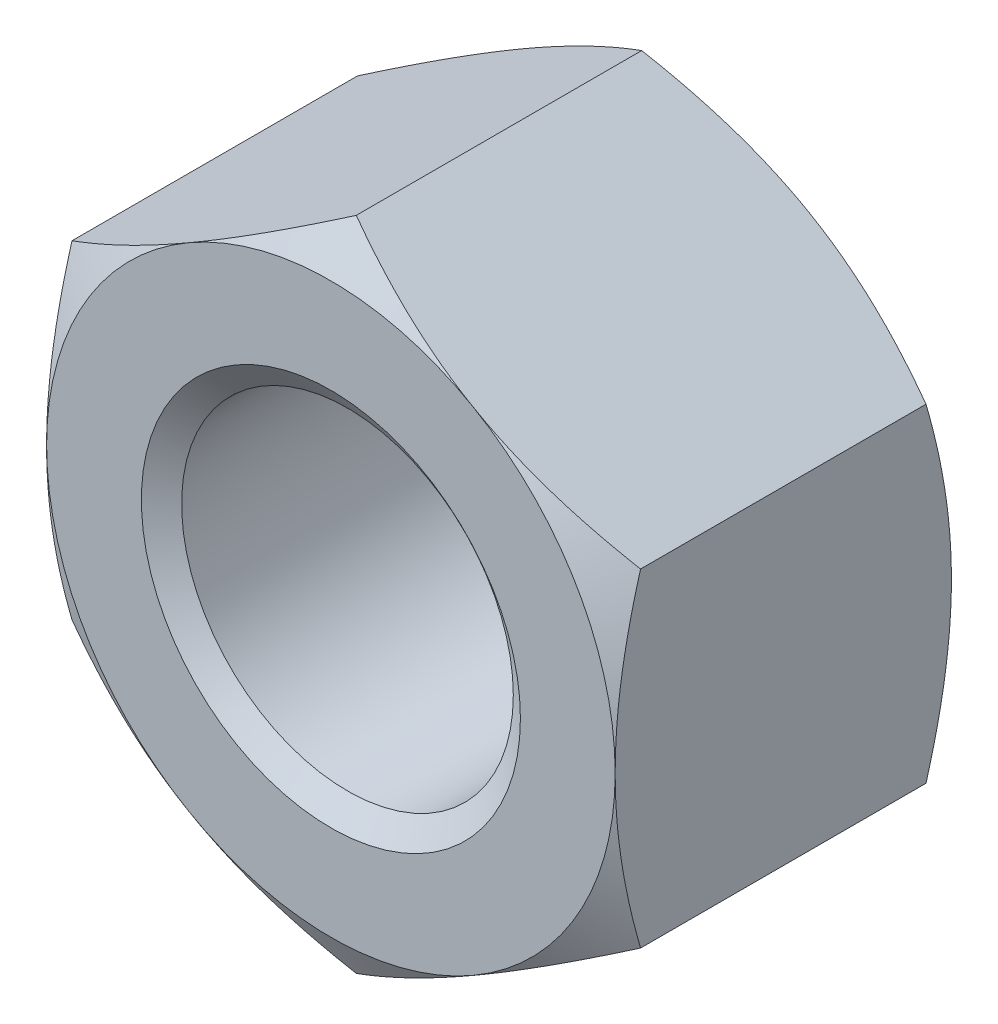
ISO-10303-21;
HEADER;
FILE_DESCRIPTION(('STEP AP214'),'2;1');
FILE_NAME('part.step','',(''),(''),'','','');
FILE_SCHEMA(('AUTOMOTIVE_DESIGN { 1 0 10303 214 1 1 1 1 }'));
ENDSEC;
DATA;
#1=APPLICATION_CONTEXT('core data for automotive mechanical design processes');
#2=APPLICATION_PROTOCOL_DEFINITION('international standard','automotive_design',2000,#1);
#3=PRODUCT_CONTEXT('',#1,'mechanical');
#4=PRODUCT('Part','Part','',(#3));
#5=PRODUCT_RELATED_PRODUCT_CATEGORY('part','',(#4));
#6=PRODUCT_DEFINITION_FORMATION('','',#4);
#7=PRODUCT_DEFINITION_CONTEXT('part definition',#1,'design');
#8=PRODUCT_DEFINITION('design','',#6,#7);
#9=PRODUCT_DEFINITION_SHAPE('','',#8);
#10=(LENGTH_UNIT() NAMED_UNIT(*) SI_UNIT(.MILLI.,.METRE.));
#11=(NAMED_UNIT(*) PLANE_ANGLE_UNIT() SI_UNIT($,.RADIAN.));
#12=(NAMED_UNIT(*) SI_UNIT($,.STERADIAN.) SOLID_ANGLE_UNIT());
#13=UNCERTAINTY_MEASURE_WITH_UNIT(LENGTH_MEASURE(1.E-05),#10,'distance_accuracy_value','');
#14=(GEOMETRIC_REPRESENTATION_CONTEXT(3) GLOBAL_UNCERTAINTY_ASSIGNED_CONTEXT((#13)) GLOBAL_UNIT_ASSIGNED_CONTEXT((#10,
#11,#12)) REPRESENTATION_CONTEXT('',''));
#15=CARTESIAN_POINT('',(0.,0.,0.));
#16=DIRECTION('',(0.,0.,1.));
#17=DIRECTION('',(1.,0.,0.));
#18=AXIS2_PLACEMENT_3D('',#15,#16,#17);
#19=CARTESIAN_POINT('',(-4.03703446649341,-0.35626989989183,-0.699912876064719));
#20=DIRECTION('',(0.,0.,1.));
#21=DIRECTION('',(1.,0.,0.));
#22=AXIS2_PLACEMENT_3D('',#19,#20,#21);
#23=CYLINDRICAL_SURFACE('',#22,1.51534090909091);
#24=CARTESIAN_POINT('',(-4.03703446649341,-0.35626989989183,2.22075356026602));
#25=DIRECTION('',(0.,0.,1.));
#26=DIRECTION('',(1.,0.,0.));
#27=AXIS2_PLACEMENT_3D('',#24,#25,#26);
#28=CIRCLE('',#27,1.51534090909091);
#29=CARTESIAN_POINT('',(-2.5216935574025,-0.35626989989183,2.22075356026602));
#30=VERTEX_POINT('',#29);
#31=EDGE_CURVE('E149',#30,#30,#28,.F.);
#32=ORIENTED_EDGE('',*,*,#31,.F.);
#33=EDGE_LOOP('',(#32));
#34=FACE_BOUND('',#33,.T.);
#35=CARTESIAN_POINT('',(-4.03703446649341,-0.35626989989183,-0.544870221486366));
#36=DIRECTION('',(0.,0.,-1.));
#37=DIRECTION('',(-1.,0.,0.));
#38=AXIS2_PLACEMENT_3D('',#35,#36,#37);
#39=CIRCLE('',#38,1.51534090909091);
#40=CARTESIAN_POINT('',(-5.55237537558432,-0.35626989989183,-0.544870221486366));
#41=VERTEX_POINT('',#40);
#42=EDGE_CURVE('E40',#41,#41,#39,.F.);
#43=ORIENTED_EDGE('',*,*,#42,.F.);
#44=EDGE_LOOP('',(#43));
#45=FACE_BOUND('',#44,.T.);
#46=ADVANCED_FACE('F35',(#34,#45),#23,.F.);
#47=CARTESIAN_POINT('',(-4.03703446649341,2.64332718048882,-0.699912876064719));
#48=DIRECTION('',(-0.500000000000001,0.866025403784438,0.));
#49=DIRECTION('',(-0.866025403784438,-0.500000000000001,0.));
#50=AXIS2_PLACEMENT_3D('',#47,#48,#49);
#51=PLANE('',#50);
#52=DIRECTION('',(0.,0.,1.));
#53=VECTOR('',#52,1.);
#54=CARTESIAN_POINT('',(-6.63476173922068,1.14352864029849,-0.699912876064719));
#55=LINE('',#54,#53);
#56=CARTESIAN_POINT('',(-6.63476173922068,1.1435286402985,-0.467893234436859));
#57=VERTEX_POINT('',#56);
#58=CARTESIAN_POINT('',(-6.63476173922068,1.14352864029849,2.14031293685288));
#59=VERTEX_POINT('',#58);
#60=EDGE_CURVE('E268',#57,#59,#55,.T.);
#61=ORIENTED_EDGE('',*,*,#60,.T.);
#62=CARTESIAN_POINT('',(-6.63478901194796,1.14351289438206,2.14030384587221));
#63=CARTESIAN_POINT('',(-6.52063417047642,1.20942022283495,2.17836708337785));
#64=CARTESIAN_POINT('',(-6.40549394705117,1.27589646182407,2.21298371984822));
#65=CARTESIAN_POINT('',(-6.17321988673153,1.40999995307538,2.27340628085991));
#66=CARTESIAN_POINT('',(-6.05608192384215,1.47762958748189,2.29919083206982));
#67=CARTESIAN_POINT('',(-5.82325764393554,1.61205074815985,2.33932670307745));
#68=CARTESIAN_POINT('',(-5.70760714175726,1.6788215967244,2.35394517441566));
#69=CARTESIAN_POINT('',(-5.47576219338577,1.81267734007693,2.37139393393209));
#70=CARTESIAN_POINT('',(-5.35956858941739,1.87976174860619,2.37423867400263));
#71=CARTESIAN_POINT('',(-5.14246971061747,2.00510384472209,2.36830839386263));
#72=CARTESIAN_POINT('',(-5.04153187324074,2.06338033230297,2.3609894548558));
#73=CARTESIAN_POINT('',(-4.84031378169044,2.17955365162535,2.33779651566822));
#74=CARTESIAN_POINT('',(-4.74003422305834,2.23745008179581,2.3219145990924));
#75=CARTESIAN_POINT('',(-4.53840153777838,2.35386276691963,2.28221253175853));
#76=CARTESIAN_POINT('',(-4.43707392013165,2.41236429424431,2.25822414990124));
#77=CARTESIAN_POINT('',(-4.23592962770355,2.52849500562363,2.20378053024325));
#78=CARTESIAN_POINT('',(-4.13611037762921,2.58612567652436,2.17333807793069));
#79=CARTESIAN_POINT('',(-4.03700719376614,2.64334292640525,2.1403038458722));
#80=B_SPLINE_CURVE_WITH_KNOTS('',3,(#62,#63,#64,#65,#66,#67,#68,#69,#70,#71,#72,#73,#74,#75,#76,
#77,#78,#79),.UNSPECIFIED.,.F.,.F.,(4,2,2,2,2,2,2,2,4),(0.,0.411762725757496,0.824514976974964,
1.22705267824216,1.62909613007785,1.97911081594798,2.32944964345564,2.68755773722039,
3.0449629404558),.UNSPECIFIED.);
#81=CARTESIAN_POINT('',(-5.33589810285705,1.89342791039365,2.37233257848074));
#82=VERTEX_POINT('',#81);
#83=EDGE_CURVE('E62',#59,#82,#80,.T.);
#84=ORIENTED_EDGE('',*,*,#83,.T.);
#85=CARTESIAN_POINT('',(-4.03703446649341,2.64332718048882,2.14031293685288));
#86=VERTEX_POINT('',#85);
#87=EDGE_CURVE('E141',#82,#86,#80,.T.);
#88=ORIENTED_EDGE('',*,*,#87,.T.);
#89=DIRECTION('',(0.,0.,1.));
#90=VECTOR('',#89,1.);
#91=CARTESIAN_POINT('',(-4.03703446649341,2.64332718048882,-0.699912876064719));
#92=LINE('',#91,#90);
#93=CARTESIAN_POINT('',(-4.03703446649341,2.64332718048882,-0.467893234436859));
#94=VERTEX_POINT('',#93);
#95=EDGE_CURVE('E155',#94,#86,#92,.T.);
#96=ORIENTED_EDGE('',*,*,#95,.F.);
#97=CARTESIAN_POINT('',(-6.63478901194796,1.14351289438206,-0.467884143456188));
#98=CARTESIAN_POINT('',(-6.52063417047642,1.20942022283495,-0.505947380961837));
#99=CARTESIAN_POINT('',(-6.40549394705117,1.27589646182407,-0.540564017432208));
#100=CARTESIAN_POINT('',(-6.17321988673153,1.40999995307538,-0.600986578443897));
#101=CARTESIAN_POINT('',(-6.05608192384215,1.47762958748189,-0.626771129653804));
#102=CARTESIAN_POINT('',(-5.82325764393554,1.61205074815985,-0.666907000661433));
#103=CARTESIAN_POINT('',(-5.70760714175726,1.6788215967244,-0.681525471999648));
#104=CARTESIAN_POINT('',(-5.47576219338577,1.81267734007693,-0.698974231516077));
#105=CARTESIAN_POINT('',(-5.35956858941739,1.87976174860619,-0.701818971586614));
#106=CARTESIAN_POINT('',(-5.14246971061747,2.00510384472209,-0.695888691446617));
#107=CARTESIAN_POINT('',(-5.04153187324074,2.06338033230297,-0.688569752439784));
#108=CARTESIAN_POINT('',(-4.84031378169044,2.17955365162535,-0.665376813252201));
#109=CARTESIAN_POINT('',(-4.74003422305835,2.23745008179581,-0.649494896676388));
#110=CARTESIAN_POINT('',(-4.53840153777838,2.35386276691963,-0.609792829342515));
#111=CARTESIAN_POINT('',(-4.43707392013165,2.41236429424431,-0.585804447485223));
#112=CARTESIAN_POINT('',(-4.23592962770354,2.52849500562363,-0.531360827827237));
#113=CARTESIAN_POINT('',(-4.13611037762921,2.58612567652436,-0.500918375514676));
#114=CARTESIAN_POINT('',(-4.03700719376614,2.64334292640525,-0.467884143456187));
#115=B_SPLINE_CURVE_WITH_KNOTS('',3,(#97,#98,#99,#100,#101,#102,#103,#104,#105,#106,#107,#108,
#109,#110,#111,#112,#113,#114),.UNSPECIFIED.,.F.,.F.,(4,2,2,2,2,2,2,2,4),(0.,0.411762725757496,
0.824514976974963,1.22705267824216,1.62909613007784,1.97911081594798,2.32944964345564,
2.68755773722039,3.0449629404558),.UNSPECIFIED.);
#116=CARTESIAN_POINT('',(-5.33589810285705,1.89342791039365,-0.699912876064719));
#117=VERTEX_POINT('',#116);
#118=EDGE_CURVE('E247',#117,#94,#115,.T.);
#119=ORIENTED_EDGE('',*,*,#118,.F.);
#120=EDGE_CURVE('E233',#57,#117,#115,.T.);
#121=ORIENTED_EDGE('',*,*,#120,.F.);
#122=EDGE_LOOP('',(#61,#84,#88,#96,#119,#121));
#123=FACE_BOUND('',#122,.T.);
#124=ADVANCED_FACE('F37',(#123),#51,.T.);
#125=CARTESIAN_POINT('',(-1.43930719376614,1.14352864029849,-0.699912876064719));
#126=DIRECTION('',(0.500000000000001,0.866025403784438,0.));
#127=DIRECTION('',(-0.866025403784438,0.500000000000001,0.));
#128=AXIS2_PLACEMENT_3D('',#125,#126,#127);
#129=PLANE('',#128);
#130=ORIENTED_EDGE('',*,*,#95,.T.);
#131=CARTESIAN_POINT('',(-4.03706173922068,2.64334292640525,2.1403038458722));
#132=CARTESIAN_POINT('',(-3.92290689774914,2.57743559795236,2.17836708337785));
#133=CARTESIAN_POINT('',(-3.80776667432389,2.51095935896324,2.21298371984822));
#134=CARTESIAN_POINT('',(-3.57549261400426,2.37685586771193,2.27340628085991));
#135=CARTESIAN_POINT('',(-3.45835465111487,2.30922623330542,2.29919083206982));
#136=CARTESIAN_POINT('',(-3.22553037120827,2.17480507262746,2.33932670307745));
#137=CARTESIAN_POINT('',(-3.10987986902999,2.10803422406291,2.35394517441566));
#138=CARTESIAN_POINT('',(-2.8780349206585,1.97417848071038,2.37139393393209));
#139=CARTESIAN_POINT('',(-2.76184131669011,1.90709407218112,2.37423867400263));
#140=CARTESIAN_POINT('',(-2.5447424378902,1.78175197606522,2.36830839386263));
#141=CARTESIAN_POINT('',(-2.44380460051347,1.72347548848434,2.3609894548558));
#142=CARTESIAN_POINT('',(-2.24258650896317,1.60730216916196,2.33779651566822));
#143=CARTESIAN_POINT('',(-2.14230695033107,1.5494057389915,2.32191459909241));
#144=CARTESIAN_POINT('',(-1.94067426505111,1.43299305386768,2.28221253175853));
#145=CARTESIAN_POINT('',(-1.83934664740438,1.374491526543,2.25822414990124));
#146=CARTESIAN_POINT('',(-1.63820235497627,1.25836081516368,2.20378053024325));
#147=CARTESIAN_POINT('',(-1.53838310490194,1.20073014426295,2.17333807793069));
#148=CARTESIAN_POINT('',(-1.43927992103886,1.14351289438206,2.14030384587221));
#149=B_SPLINE_CURVE_WITH_KNOTS('',3,(#131,#132,#133,#134,#135,#136,#137,#138,#139,#140,#141,
#142,#143,#144,#145,#146,#147,#148),.UNSPECIFIED.,.F.,.F.,(4,2,2,2,2,2,2,2,4),(0.,
0.411762725757496,0.824514976974964,1.22705267824216,1.62909613007785,1.97911081594798,
2.32944964345564,2.68755773722039,3.0449629404558),.UNSPECIFIED.);
#150=CARTESIAN_POINT('',(-2.73817083012977,1.89342791039365,2.37233257848074));
#151=VERTEX_POINT('',#150);
#152=EDGE_CURVE('E136',#86,#151,#149,.T.);
#153=ORIENTED_EDGE('',*,*,#152,.T.);
#154=CARTESIAN_POINT('',(-1.43930719376614,1.1435286402985,2.14031293685288));
#155=VERTEX_POINT('',#154);
#156=EDGE_CURVE('E127',#151,#155,#149,.T.);
#157=ORIENTED_EDGE('',*,*,#156,.T.);
#158=DIRECTION('',(0.,0.,1.));
#159=VECTOR('',#158,1.);
#160=CARTESIAN_POINT('',(-1.43930719376614,1.14352864029849,-0.699912876064719));
#161=LINE('',#160,#159);
#162=CARTESIAN_POINT('',(-1.43930719376614,1.1435286402985,-0.467893234436859));
#163=VERTEX_POINT('',#162);
#164=EDGE_CURVE('E257',#163,#155,#161,.T.);
#165=ORIENTED_EDGE('',*,*,#164,.F.);
#166=CARTESIAN_POINT('',(-4.03706173922068,2.64334292640525,-0.467884143456187));
#167=CARTESIAN_POINT('',(-3.92290689774914,2.57743559795236,-0.505947380961835));
#168=CARTESIAN_POINT('',(-3.80776667432389,2.51095935896324,-0.540564017432206));
#169=CARTESIAN_POINT('',(-3.57549261400426,2.37685586771193,-0.600986578443895));
#170=CARTESIAN_POINT('',(-3.45835465111487,2.30922623330542,-0.626771129653803));
#171=CARTESIAN_POINT('',(-3.22553037120827,2.17480507262746,-0.666907000661432));
#172=CARTESIAN_POINT('',(-3.10987986902999,2.10803422406291,-0.681525471999648));
#173=CARTESIAN_POINT('',(-2.8780349206585,1.97417848071038,-0.698974231516077));
#174=CARTESIAN_POINT('',(-2.76184131669011,1.90709407218112,-0.701818971586614));
#175=CARTESIAN_POINT('',(-2.5447424378902,1.78175197606522,-0.695888691446617));
#176=CARTESIAN_POINT('',(-2.44380460051347,1.72347548848434,-0.688569752439785));
#177=CARTESIAN_POINT('',(-2.24258650896317,1.60730216916196,-0.665376813252201));
#178=CARTESIAN_POINT('',(-2.14230695033107,1.5494057389915,-0.649494896676389));
#179=CARTESIAN_POINT('',(-1.9406742650511,1.43299305386768,-0.609792829342516));
#180=CARTESIAN_POINT('',(-1.83934664740438,1.374491526543,-0.585804447485224));
#181=CARTESIAN_POINT('',(-1.63820235497627,1.25836081516368,-0.531360827827239));
#182=CARTESIAN_POINT('',(-1.53838310490194,1.20073014426295,-0.500918375514677));
#183=CARTESIAN_POINT('',(-1.43927992103886,1.14351289438206,-0.467884143456188));
#184=B_SPLINE_CURVE_WITH_KNOTS('',3,(#166,#167,#168,#169,#170,#171,#172,#173,#174,#175,#176,
#177,#178,#179,#180,#181,#182,#183),.UNSPECIFIED.,.F.,.F.,(4,2,2,2,2,2,2,2,4),(0.,
0.411762725757496,0.824514976974964,1.22705267824216,1.62909613007785,1.97911081594798,
2.32944964345564,2.68755773722039,3.0449629404558),.UNSPECIFIED.);
#185=CARTESIAN_POINT('',(-2.73817083012977,1.89342791039365,-0.699912876064719));
#186=VERTEX_POINT('',#185);
#187=EDGE_CURVE('E248',#186,#163,#184,.T.);
#188=ORIENTED_EDGE('',*,*,#187,.F.);
#189=EDGE_CURVE('E254',#94,#186,#184,.T.);
#190=ORIENTED_EDGE('',*,*,#189,.F.);
#191=EDGE_LOOP('',(#130,#153,#157,#165,#188,#190));
#192=FACE_BOUND('',#191,.T.);
#193=ADVANCED_FACE('F152',(#192),#129,.T.);
#194=CARTESIAN_POINT('',(-1.43930719376614,1.14352864029849,-0.699912876064719));
#195=DIRECTION('',(-1.,0.,0.));
#196=DIRECTION('',(0.,0.,1.));
#197=AXIS2_PLACEMENT_3D('',#194,#195,#196);
#198=PLANE('',#197);
#199=CARTESIAN_POINT('',(-1.43930719376614,-4.3339566524617,1.12925070536823));
#200=CARTESIAN_POINT('',(-1.43930719376614,-4.2199017353191,1.18436834127248));
#201=CARTESIAN_POINT('',(-1.43930719376614,-4.10557715469242,1.23893806225811));
#202=CARTESIAN_POINT('',(-1.43930719376614,-3.87624285955771,1.346668576896));
#203=CARTESIAN_POINT('',(-1.43930719376614,-3.76123303059325,1.39982912660817));
#204=CARTESIAN_POINT('',(-1.43930719376614,-3.52976115805929,1.50470825389215));
#205=CARTESIAN_POINT('',(-1.43930719376614,-3.41329457040623,1.55641683873242));
#206=CARTESIAN_POINT('',(-1.43930719376614,-3.17940414202886,1.65761299942654));
#207=CARTESIAN_POINT('',(-1.43930719376614,-3.06198035157966,1.70710069105139));
#208=CARTESIAN_POINT('',(-1.43930719376614,-2.82453103517311,1.8038520140485));
#209=CARTESIAN_POINT('',(-1.43930719376614,-2.70449126634877,1.85108088197011));
#210=CARTESIAN_POINT('',(-1.43930719376614,-2.46299584924777,1.94183966257926));
#211=CARTESIAN_POINT('',(-1.43930719376614,-2.3415400451492,1.98536916373159));
#212=CARTESIAN_POINT('',(-1.43930719376614,-2.09726878491488,2.06755958503955));
#213=CARTESIAN_POINT('',(-1.43930719376614,-1.97445684741333,2.10623085577737));
#214=CARTESIAN_POINT('',(-1.43930719376614,-1.7270870399417,2.17744889863394));
#215=CARTESIAN_POINT('',(-1.43930719376614,-1.60252973553563,2.20999760753726));
#216=CARTESIAN_POINT('',(-1.43930719376614,-1.35158412133525,2.26739037471229));
#217=CARTESIAN_POINT('',(-1.43930719376614,-1.2251953333701,2.29223238152146));
#218=CARTESIAN_POINT('',(-1.43930719376614,-0.970893942887478,2.33253914003799));
#219=CARTESIAN_POINT('',(-1.43930719376614,-0.842981339022862,2.34800388345466));
#220=CARTESIAN_POINT('',(-1.43930719376614,-0.587111731792263,2.3681880259638));
#221=CARTESIAN_POINT('',(-1.43930719376614,-0.459160234312559,2.3729754515318));
#222=CARTESIAN_POINT('',(-1.43930719376614,-0.203346835204729,2.37155061946574));
#223=CARTESIAN_POINT('',(-1.43930719376614,-0.0754849189402348,2.36534121712736));
#224=CARTESIAN_POINT('',(-1.43930719376614,0.142857830825622,2.34578462753566));
#225=CARTESIAN_POINT('',(-1.43930719376614,0.233579548295879,2.33498421178859));
#226=CARTESIAN_POINT('',(-1.43930719376614,0.414322185219373,2.30854966482945));
#227=CARTESIAN_POINT('',(-1.43930719376614,0.504342991852217,2.29291477128881));
#228=CARTESIAN_POINT('',(-1.43930719376614,0.773280662339633,2.23957892728977));
#229=CARTESIAN_POINT('',(-1.43930719376614,0.950936925530459,2.19546054598986));
#230=CARTESIAN_POINT('',(-1.43930719376614,1.21677250462859,2.11936826103781));
#231=CARTESIAN_POINT('',(-1.43930719376614,1.30633748681971,2.09196380831558));
#232=CARTESIAN_POINT('',(-1.43930719376614,1.48453263336326,2.03444321757147));
#233=CARTESIAN_POINT('',(-1.43930719376614,1.5731633960327,2.00432894988891));
#234=CARTESIAN_POINT('',(-1.43930719376614,1.74911947800686,1.94201535452446));
#235=CARTESIAN_POINT('',(-1.43930719376614,1.83644933722878,1.9098287170397));
#236=CARTESIAN_POINT('',(-1.43930719376614,2.01043149270914,1.84356626121782));
#237=CARTESIAN_POINT('',(-1.43930719376614,2.09708349874232,1.80948967933807));
#238=CARTESIAN_POINT('',(-1.43930719376614,2.18342219068641,1.77465462707322));
#239=B_SPLINE_CURVE_WITH_KNOTS('',3,(#199,#200,#201,#202,#203,#204,#205,#206,#207,#208,#209,
#210,#211,#212,#213,#214,#215,#216,#217,#218,#219,#220,#221,#222,#223,#224,#225,#226,#227,#228,
#229,#230,#231,#232,#233,#234,#235,#236,#237,#238),.UNSPECIFIED.,.F.,.F.,(4,2,2,2,2,2,2,2,2,2,2,
2,2,2,2,2,2,2,2,4),(0.,0.380029181172941,0.760123724758491,1.14239339591115,1.5246431168611,
1.91158567806886,2.29857122841938,2.68471778607585,3.07074198562752,3.45686885374169,
3.84299606324005,4.22665609619972,4.61021652750702,4.8841698009293,5.15816629494622,
5.7065670717288,5.98753589323319,6.26831225354494,6.54750821586453,6.82681780759916),.UNSPECIFIED.);
#240=CARTESIAN_POINT('',(-1.43930719376614,-1.85606844008216,2.14031293685288));
#241=VERTEX_POINT('',#240);
#242=CARTESIAN_POINT('',(-1.43930719376614,-0.35626989989183,2.37233257848074));
#243=VERTEX_POINT('',#242);
#244=EDGE_CURVE('E211',#241,#243,#239,.T.);
#245=ORIENTED_EDGE('',*,*,#244,.F.);
#246=DIRECTION('',(0.,0.,1.));
#247=VECTOR('',#246,1.);
#248=CARTESIAN_POINT('',(-1.43930719376614,-1.85606844008216,-0.699912876064719));
#249=LINE('',#248,#247);
#250=CARTESIAN_POINT('',(-1.43930719376614,-1.85606844008216,-0.467893234436859));
#251=VERTEX_POINT('',#250);
#252=EDGE_CURVE('E259',#251,#241,#249,.T.);
#253=ORIENTED_EDGE('',*,*,#252,.F.);
#254=CARTESIAN_POINT('',(-1.43930719376614,-4.3339566524617,0.543168997047789));
#255=CARTESIAN_POINT('',(-1.43930719376614,-4.2199017353191,0.488051361143536));
#256=CARTESIAN_POINT('',(-1.43930719376614,-4.10557715469242,0.433481640157906));
#257=CARTESIAN_POINT('',(-1.43930719376614,-3.87624285955771,0.325751125520012));
#258=CARTESIAN_POINT('',(-1.43930719376614,-3.76123303059325,0.272590575807846));
#259=CARTESIAN_POINT('',(-1.43930719376614,-3.52976115805929,0.167711448523863));
#260=CARTESIAN_POINT('',(-1.43930719376614,-3.41329457040623,0.116002863683592));
#261=CARTESIAN_POINT('',(-1.43930719376614,-3.17940414202886,0.0148067029894731));
#262=CARTESIAN_POINT('',(-1.43930719376614,-3.06198035157966,-0.034680988635374));
#263=CARTESIAN_POINT('',(-1.43930719376614,-2.82453103517311,-0.131432311632481));
#264=CARTESIAN_POINT('',(-1.43930719376614,-2.70449126634877,-0.178661179554097));
#265=CARTESIAN_POINT('',(-1.43930719376614,-2.46299584924777,-0.269419960163239));
#266=CARTESIAN_POINT('',(-1.43930719376614,-2.3415400451492,-0.312949461315569));
#267=CARTESIAN_POINT('',(-1.43930719376614,-2.09726878491488,-0.395139882623531));
#268=CARTESIAN_POINT('',(-1.43930719376614,-1.97445684741333,-0.433811153361356));
#269=CARTESIAN_POINT('',(-1.43930719376614,-1.72708703994169,-0.50502919621792));
#270=CARTESIAN_POINT('',(-1.43930719376614,-1.60252973553563,-0.537577905121239));
#271=CARTESIAN_POINT('',(-1.43930719376614,-1.35158412133525,-0.594970672296271));
#272=CARTESIAN_POINT('',(-1.43930719376614,-1.2251953333701,-0.619812679105443));
#273=CARTESIAN_POINT('',(-1.43930719376614,-0.970893942887477,-0.660119437621969));
#274=CARTESIAN_POINT('',(-1.43930719376614,-0.842981339022862,-0.675584181038643));
#275=CARTESIAN_POINT('',(-1.43930719376614,-0.587111731792263,-0.695768323547783));
#276=CARTESIAN_POINT('',(-1.43930719376614,-0.45916023431256,-0.700555749115782));
#277=CARTESIAN_POINT('',(-1.43930719376614,-0.203346835204729,-0.699130917049725));
#278=CARTESIAN_POINT('',(-1.43930719376614,-0.075484918940235,-0.692921514711342));
#279=CARTESIAN_POINT('',(-1.43930719376614,0.142857830825622,-0.673364925119646));
#280=CARTESIAN_POINT('',(-1.43930719376614,0.233579548295879,-0.66256450937257));
#281=CARTESIAN_POINT('',(-1.43930719376614,0.414322185219373,-0.636129962413435));
#282=CARTESIAN_POINT('',(-1.43930719376614,0.504342991852217,-0.620495068872791));
#283=CARTESIAN_POINT('',(-1.43930719376614,0.773280662339632,-0.567159224873754));
#284=CARTESIAN_POINT('',(-1.43930719376614,0.950936925530458,-0.523040843573848));
#285=CARTESIAN_POINT('',(-1.43930719376614,1.21677250462859,-0.446948558621798));
#286=CARTESIAN_POINT('',(-1.43930719376614,1.30633748681971,-0.419544105899562));
#287=CARTESIAN_POINT('',(-1.43930719376614,1.48453263336326,-0.362023515155454));
#288=CARTESIAN_POINT('',(-1.43930719376614,1.5731633960327,-0.331909247472893));
#289=CARTESIAN_POINT('',(-1.43930719376614,1.74911947800686,-0.269595652108448));
#290=CARTESIAN_POINT('',(-1.43930719376614,1.83644933722878,-0.237409014623685));
#291=CARTESIAN_POINT('',(-1.43930719376614,2.01043149270914,-0.1711465588018));
#292=CARTESIAN_POINT('',(-1.43930719376614,2.09708349874232,-0.137069976922051));
#293=CARTESIAN_POINT('',(-1.43930719376614,2.18342219068641,-0.102234924657201));
#294=B_SPLINE_CURVE_WITH_KNOTS('',3,(#254,#255,#256,#257,#258,#259,#260,#261,#262,#263,#264,
#265,#266,#267,#268,#269,#270,#271,#272,#273,#274,#275,#276,#277,#278,#279,#280,#281,#282,#283,
#284,#285,#286,#287,#288,#289,#290,#291,#292,#293),.UNSPECIFIED.,.F.,.F.,(4,2,2,2,2,2,2,2,2,2,2,
2,2,2,2,2,2,2,2,4),(0.,0.380029181172941,0.760123724758491,1.14239339591115,1.5246431168611,
1.91158567806885,2.29857122841938,2.68471778607585,3.07074198562752,3.45686885374169,
3.84299606324004,4.22665609619972,4.61021652750702,4.8841698009293,5.15816629494622,
5.7065670717288,5.98753589323319,6.26831225354494,6.54750821586452,6.82681780759916),.UNSPECIFIED.);
#295=CARTESIAN_POINT('',(-1.43930719376614,-0.35626989989183,-0.699912876064719));
#296=VERTEX_POINT('',#295);
#297=EDGE_CURVE('E225',#251,#296,#294,.T.);
#298=ORIENTED_EDGE('',*,*,#297,.T.);
#299=EDGE_CURVE('E235',#296,#163,#294,.T.);
#300=ORIENTED_EDGE('',*,*,#299,.T.);
#301=ORIENTED_EDGE('',*,*,#164,.T.);
#302=EDGE_CURVE('E131',#243,#155,#239,.T.);
#303=ORIENTED_EDGE('',*,*,#302,.F.);
#304=EDGE_LOOP('',(#245,#253,#298,#300,#301,#303));
#305=FACE_BOUND('',#304,.T.);
#306=ADVANCED_FACE('F217',(#305),#198,.F.);
#307=CARTESIAN_POINT('',(-4.03703446649341,-3.35586698027248,-0.699912876064719));
#308=DIRECTION('',(0.500000000000001,-0.866025403784438,0.));
#309=DIRECTION('',(0.866025403784438,0.500000000000001,0.));
#310=AXIS2_PLACEMENT_3D('',#307,#308,#309);
#311=PLANE('',#310);
#312=ORIENTED_EDGE('',*,*,#252,.T.);
#313=CARTESIAN_POINT('',(-1.43927992103886,-1.85605269416572,2.1403038458722));
#314=CARTESIAN_POINT('',(-1.5534347625104,-1.92196002261862,2.17836708337785));
#315=CARTESIAN_POINT('',(-1.66857498593565,-1.98843626160774,2.21298371984822));
#316=CARTESIAN_POINT('',(-1.90084904625529,-2.12253975285905,2.27340628085991));
#317=CARTESIAN_POINT('',(-2.01798700914467,-2.19016938726556,2.29919083206982));
#318=CARTESIAN_POINT('',(-2.25081128905128,-2.32459054794352,2.33932670307745));
#319=CARTESIAN_POINT('',(-2.36646179122956,-2.39136139650806,2.35394517441566));
#320=CARTESIAN_POINT('',(-2.59830673960105,-2.5252171398606,2.37139393393209));
#321=CARTESIAN_POINT('',(-2.71450034356943,-2.59230154838986,2.37423867400263));
#322=CARTESIAN_POINT('',(-2.93159922236935,-2.71764364450575,2.36830839386263));
#323=CARTESIAN_POINT('',(-3.03253705974608,-2.77592013208663,2.3609894548558));
#324=CARTESIAN_POINT('',(-3.23375515129638,-2.89209345140902,2.33779651566821));
#325=CARTESIAN_POINT('',(-3.33403470992847,-2.94998988157948,2.3219145990924));
#326=CARTESIAN_POINT('',(-3.53566739520844,-3.06640256670329,2.28221253175853));
#327=CARTESIAN_POINT('',(-3.63699501285517,-3.12490409402798,2.25822414990124));
#328=CARTESIAN_POINT('',(-3.83813930528327,-3.2410348054073,2.20378053024325));
#329=CARTESIAN_POINT('',(-3.93795855535761,-3.29866547630802,2.17333807793069));
#330=CARTESIAN_POINT('',(-4.03706173922068,-3.35588272618892,2.1403038458722));
#331=B_SPLINE_CURVE_WITH_KNOTS('',3,(#313,#314,#315,#316,#317,#318,#319,#320,#321,#322,#323,
#324,#325,#326,#327,#328,#329,#330),.UNSPECIFIED.,.F.,.F.,(4,2,2,2,2,2,2,2,4),(0.,
0.411762725757497,0.824514976974964,1.22705267824216,1.62909613007785,1.97911081594798,
2.32944964345564,2.68755773722039,3.0449629404558),.UNSPECIFIED.);
#332=CARTESIAN_POINT('',(-2.73817083012977,-2.60596771017731,2.37233257848074));
#333=VERTEX_POINT('',#332);
#334=EDGE_CURVE('E216',#241,#333,#331,.T.);
#335=ORIENTED_EDGE('',*,*,#334,.T.);
#336=CARTESIAN_POINT('',(-4.03703446649342,-3.35586698027248,2.14031293685288));
#337=VERTEX_POINT('',#336);
#338=EDGE_CURVE('E205',#333,#337,#331,.T.);
#339=ORIENTED_EDGE('',*,*,#338,.T.);
#340=DIRECTION('',(0.,0.,1.));
#341=VECTOR('',#340,1.);
#342=CARTESIAN_POINT('',(-4.03703446649341,-3.35586698027248,-0.699912876064719));
#343=LINE('',#342,#341);
#344=CARTESIAN_POINT('',(-4.03703446649342,-3.35586698027248,-0.467893234436859));
#345=VERTEX_POINT('',#344);
#346=EDGE_CURVE('E262',#345,#337,#343,.T.);
#347=ORIENTED_EDGE('',*,*,#346,.F.);
#348=CARTESIAN_POINT('',(-1.43927992103886,-1.85605269416572,-0.467884143456187));
#349=CARTESIAN_POINT('',(-1.5534347625104,-1.92196002261862,-0.505947380961835));
#350=CARTESIAN_POINT('',(-1.66857498593565,-1.98843626160774,-0.540564017432206));
#351=CARTESIAN_POINT('',(-1.90084904625529,-2.12253975285905,-0.600986578443895));
#352=CARTESIAN_POINT('',(-2.01798700914467,-2.19016938726556,-0.626771129653802));
#353=CARTESIAN_POINT('',(-2.25081128905128,-2.32459054794352,-0.66690700066143));
#354=CARTESIAN_POINT('',(-2.36646179122956,-2.39136139650806,-0.681525471999646));
#355=CARTESIAN_POINT('',(-2.59830673960105,-2.5252171398606,-0.698974231516074));
#356=CARTESIAN_POINT('',(-2.71450034356943,-2.59230154838986,-0.701818971586611));
#357=CARTESIAN_POINT('',(-2.93159922236935,-2.71764364450575,-0.695888691446614));
#358=CARTESIAN_POINT('',(-3.03253705974608,-2.77592013208663,-0.688569752439781));
#359=CARTESIAN_POINT('',(-3.23375515129638,-2.89209345140902,-0.665376813252197));
#360=CARTESIAN_POINT('',(-3.33403470992847,-2.94998988157948,-0.649494896676384));
#361=CARTESIAN_POINT('',(-3.53566739520844,-3.06640256670329,-0.609792829342511));
#362=CARTESIAN_POINT('',(-3.63699501285517,-3.12490409402798,-0.585804447485219));
#363=CARTESIAN_POINT('',(-3.83813930528327,-3.2410348054073,-0.531360827827233));
#364=CARTESIAN_POINT('',(-3.93795855535761,-3.29866547630802,-0.500918375514671));
#365=CARTESIAN_POINT('',(-4.03706173922068,-3.35588272618892,-0.467884143456183));
#366=B_SPLINE_CURVE_WITH_KNOTS('',3,(#348,#349,#350,#351,#352,#353,#354,#355,#356,#357,#358,
#359,#360,#361,#362,#363,#364,#365),.UNSPECIFIED.,.F.,.F.,(4,2,2,2,2,2,2,2,4),(0.,
0.411762725757496,0.824514976974964,1.22705267824216,1.62909613007785,1.97911081594798,
2.32944964345564,2.68755773722039,3.0449629404558),.UNSPECIFIED.);
#367=CARTESIAN_POINT('',(-2.73817083012977,-2.60596771017731,-0.699912876064719));
#368=VERTEX_POINT('',#367);
#369=EDGE_CURVE('E236',#368,#345,#366,.T.);
#370=ORIENTED_EDGE('',*,*,#369,.F.);
#371=EDGE_CURVE('E234',#251,#368,#366,.T.);
#372=ORIENTED_EDGE('',*,*,#371,.F.);
#373=EDGE_LOOP('',(#312,#335,#339,#347,#370,#372));
#374=FACE_BOUND('',#373,.T.);
#375=ADVANCED_FACE('F220',(#374),#311,.T.);
#376=CARTESIAN_POINT('',(-6.63476173922068,-1.85606844008216,-0.699912876064719));
#377=DIRECTION('',(-0.500000000000001,-0.866025403784438,0.));
#378=DIRECTION('',(0.866025403784438,-0.500000000000001,0.));
#379=AXIS2_PLACEMENT_3D('',#376,#377,#378);
#380=PLANE('',#379);
#381=ORIENTED_EDGE('',*,*,#346,.T.);
#382=CARTESIAN_POINT('',(-4.03700719376614,-3.35588272618892,2.1403038458722));
#383=CARTESIAN_POINT('',(-4.15116203523768,-3.28997539773603,2.17836708337785));
#384=CARTESIAN_POINT('',(-4.26630225866292,-3.2234991587469,2.21298371984822));
#385=CARTESIAN_POINT('',(-4.49857631898256,-3.08939566749559,2.27340628085991));
#386=CARTESIAN_POINT('',(-4.61571428187194,-3.02176603308908,2.29919083206982));
#387=CARTESIAN_POINT('',(-4.84853856177855,-2.88734487241112,2.33932670307745));
#388=CARTESIAN_POINT('',(-4.96418906395683,-2.82057402384658,2.35394517441566));
#389=CARTESIAN_POINT('',(-5.19603401232832,-2.68671828049404,2.37139393393209));
#390=CARTESIAN_POINT('',(-5.31222761629671,-2.61963387196478,2.37423867400263));
#391=CARTESIAN_POINT('',(-5.52932649509662,-2.49429177584889,2.36830839386263));
#392=CARTESIAN_POINT('',(-5.63026433247336,-2.43601528826801,2.3609894548558));
#393=CARTESIAN_POINT('',(-5.83148242402366,-2.31984196894562,2.33779651566821));
#394=CARTESIAN_POINT('',(-5.93176198265575,-2.26194553877516,2.3219145990924));
#395=CARTESIAN_POINT('',(-6.13339466793572,-2.14553285365135,2.28221253175853));
#396=CARTESIAN_POINT('',(-6.23472228558244,-2.08703132632666,2.25822414990124));
#397=CARTESIAN_POINT('',(-6.43586657801055,-1.97090061494734,2.20378053024325));
#398=CARTESIAN_POINT('',(-6.53568582808488,-1.91326994404662,2.17333807793069));
#399=CARTESIAN_POINT('',(-6.63478901194796,-1.85605269416572,2.1403038458722));
#400=B_SPLINE_CURVE_WITH_KNOTS('',3,(#382,#383,#384,#385,#386,#387,#388,#389,#390,#391,#392,
#393,#394,#395,#396,#397,#398,#399),.UNSPECIFIED.,.F.,.F.,(4,2,2,2,2,2,2,2,4),(0.,
0.411762725757497,0.824514976974966,1.22705267824216,1.62909613007785,1.97911081594799,
2.32944964345565,2.68755773722039,3.0449629404558),.UNSPECIFIED.);
#401=CARTESIAN_POINT('',(-5.33589810285705,-2.60596771017731,2.37233257848074));
#402=VERTEX_POINT('',#401);
#403=EDGE_CURVE('E357',#337,#402,#400,.T.);
#404=ORIENTED_EDGE('',*,*,#403,.T.);
#405=CARTESIAN_POINT('',(-6.63476173922068,-1.85606844008216,2.14031293685288));
#406=VERTEX_POINT('',#405);
#407=EDGE_CURVE('E197',#402,#406,#400,.T.);
#408=ORIENTED_EDGE('',*,*,#407,.T.);
#409=DIRECTION('',(0.,0.,1.));
#410=VECTOR('',#409,1.);
#411=CARTESIAN_POINT('',(-6.63476173922068,-1.85606844008216,-0.699912876064719));
#412=LINE('',#411,#410);
#413=CARTESIAN_POINT('',(-6.63476173922068,-1.85606844008216,-0.467893234436859));
#414=VERTEX_POINT('',#413);
#415=EDGE_CURVE('E265',#414,#406,#412,.T.);
#416=ORIENTED_EDGE('',*,*,#415,.F.);
#417=CARTESIAN_POINT('',(-4.03700719376614,-3.35588272618892,-0.467884143456183));
#418=CARTESIAN_POINT('',(-4.15116203523768,-3.28997539773603,-0.505947380961831));
#419=CARTESIAN_POINT('',(-4.26630225866292,-3.2234991587469,-0.540564017432202));
#420=CARTESIAN_POINT('',(-4.49857631898256,-3.08939566749559,-0.600986578443892));
#421=CARTESIAN_POINT('',(-4.61571428187194,-3.02176603308908,-0.626771129653799));
#422=CARTESIAN_POINT('',(-4.84853856177855,-2.88734487241112,-0.666907000661429));
#423=CARTESIAN_POINT('',(-4.96418906395683,-2.82057402384658,-0.681525471999644));
#424=CARTESIAN_POINT('',(-5.19603401232832,-2.68671828049404,-0.698974231516073));
#425=CARTESIAN_POINT('',(-5.31222761629671,-2.61963387196478,-0.701818971586611));
#426=CARTESIAN_POINT('',(-5.52932649509662,-2.49429177584889,-0.695888691446614));
#427=CARTESIAN_POINT('',(-5.63026433247336,-2.43601528826801,-0.688569752439782));
#428=CARTESIAN_POINT('',(-5.83148242402366,-2.31984196894562,-0.665376813252198));
#429=CARTESIAN_POINT('',(-5.93176198265575,-2.26194553877516,-0.649494896676385));
#430=CARTESIAN_POINT('',(-6.13339466793572,-2.14553285365135,-0.609792829342513));
#431=CARTESIAN_POINT('',(-6.23472228558244,-2.08703132632666,-0.585804447485221));
#432=CARTESIAN_POINT('',(-6.43586657801055,-1.97090061494734,-0.531360827827236));
#433=CARTESIAN_POINT('',(-6.53568582808488,-1.91326994404662,-0.500918375514675));
#434=CARTESIAN_POINT('',(-6.63478901194796,-1.85605269416572,-0.467884143456186));
#435=B_SPLINE_CURVE_WITH_KNOTS('',3,(#417,#418,#419,#420,#421,#422,#423,#424,#425,#426,#427,
#428,#429,#430,#431,#432,#433,#434),.UNSPECIFIED.,.F.,.F.,(4,2,2,2,2,2,2,2,4),(0.,
0.411762725757496,0.824514976974966,1.22705267824216,1.62909613007785,1.97911081594799,
2.32944964345565,2.68755773722039,3.0449629404558),.UNSPECIFIED.);
#436=CARTESIAN_POINT('',(-5.33589810285705,-2.60596771017731,-0.699912876064719));
#437=VERTEX_POINT('',#436);
#438=EDGE_CURVE('E375',#437,#414,#435,.T.);
#439=ORIENTED_EDGE('',*,*,#438,.F.);
#440=EDGE_CURVE('E395',#345,#437,#435,.T.);
#441=ORIENTED_EDGE('',*,*,#440,.F.);
#442=EDGE_LOOP('',(#381,#404,#408,#416,#439,#441));
#443=FACE_BOUND('',#442,.T.);
#444=ADVANCED_FACE('F304',(#443),#380,.T.);
#445=CARTESIAN_POINT('',(-6.63476173922068,1.14352864029849,-0.699912876064719));
#446=DIRECTION('',(-1.,0.,0.));
#447=DIRECTION('',(0.,0.,1.));
#448=AXIS2_PLACEMENT_3D('',#445,#446,#447);
#449=PLANE('',#448);
#450=ORIENTED_EDGE('',*,*,#415,.T.);
#451=CARTESIAN_POINT('',(-6.63476173922068,-4.3339566524617,1.12925070536823));
#452=CARTESIAN_POINT('',(-6.63476173922068,-4.2199017353191,1.18436834127248));
#453=CARTESIAN_POINT('',(-6.63476173922068,-4.10557715469242,1.23893806225811));
#454=CARTESIAN_POINT('',(-6.63476173922068,-3.87624285955771,1.346668576896));
#455=CARTESIAN_POINT('',(-6.63476173922068,-3.76123303059325,1.39982912660817));
#456=CARTESIAN_POINT('',(-6.63476173922068,-3.52976115805929,1.50470825389215));
#457=CARTESIAN_POINT('',(-6.63476173922068,-3.41329457040623,1.55641683873242));
#458=CARTESIAN_POINT('',(-6.63476173922068,-3.17940414202886,1.65761299942654));
#459=CARTESIAN_POINT('',(-6.63476173922068,-3.06198035157966,1.70710069105139));
#460=CARTESIAN_POINT('',(-6.63476173922068,-2.82453103517311,1.8038520140485));
#461=CARTESIAN_POINT('',(-6.63476173922068,-2.70449126634877,1.85108088197011));
#462=CARTESIAN_POINT('',(-6.63476173922068,-2.46299584924777,1.94183966257926));
#463=CARTESIAN_POINT('',(-6.63476173922068,-2.3415400451492,1.98536916373159));
#464=CARTESIAN_POINT('',(-6.63476173922068,-2.09726878491488,2.06755958503955));
#465=CARTESIAN_POINT('',(-6.63476173922068,-1.97445684741333,2.10623085577737));
#466=CARTESIAN_POINT('',(-6.63476173922068,-1.7270870399417,2.17744889863394));
#467=CARTESIAN_POINT('',(-6.63476173922068,-1.60252973553563,2.20999760753726));
#468=CARTESIAN_POINT('',(-6.63476173922068,-1.35158412133525,2.26739037471229));
#469=CARTESIAN_POINT('',(-6.63476173922068,-1.2251953333701,2.29223238152146));
#470=CARTESIAN_POINT('',(-6.63476173922068,-0.970893942887477,2.33253914003799));
#471=CARTESIAN_POINT('',(-6.63476173922068,-0.842981339022862,2.34800388345466));
#472=CARTESIAN_POINT('',(-6.63476173922068,-0.587111731792263,2.3681880259638));
#473=CARTESIAN_POINT('',(-6.63476173922068,-0.459160234312559,2.3729754515318));
#474=CARTESIAN_POINT('',(-6.63476173922068,-0.203346835204728,2.37155061946574));
#475=CARTESIAN_POINT('',(-6.63476173922068,-0.0754849189402347,2.36534121712736));
#476=CARTESIAN_POINT('',(-6.63476173922068,0.142857830825622,2.34578462753566));
#477=CARTESIAN_POINT('',(-6.63476173922068,0.233579548295879,2.33498421178859));
#478=CARTESIAN_POINT('',(-6.63476173922068,0.414322185219373,2.30854966482945));
#479=CARTESIAN_POINT('',(-6.63476173922068,0.504342991852218,2.29291477128881));
#480=CARTESIAN_POINT('',(-6.63476173922068,0.773280662339633,2.23957892728977));
#481=CARTESIAN_POINT('',(-6.63476173922068,0.950936925530458,2.19546054598986));
#482=CARTESIAN_POINT('',(-6.63476173922068,1.21677250462859,2.11936826103781));
#483=CARTESIAN_POINT('',(-6.63476173922068,1.30633748681971,2.09196380831558));
#484=CARTESIAN_POINT('',(-6.63476173922068,1.48453263336326,2.03444321757147));
#485=CARTESIAN_POINT('',(-6.63476173922068,1.5731633960327,2.00432894988891));
#486=CARTESIAN_POINT('',(-6.63476173922068,1.74911947800686,1.94201535452446));
#487=CARTESIAN_POINT('',(-6.63476173922068,1.83644933722878,1.9098287170397));
#488=CARTESIAN_POINT('',(-6.63476173922068,2.01043149270915,1.84356626121782));
#489=CARTESIAN_POINT('',(-6.63476173922068,2.09708349874232,1.80948967933807));
#490=CARTESIAN_POINT('',(-6.63476173922068,2.18342219068641,1.77465462707322));
#491=B_SPLINE_CURVE_WITH_KNOTS('',3,(#451,#452,#453,#454,#455,#456,#457,#458,#459,#460,#461,
#462,#463,#464,#465,#466,#467,#468,#469,#470,#471,#472,#473,#474,#475,#476,#477,#478,#479,#480,
#481,#482,#483,#484,#485,#486,#487,#488,#489,#490),.UNSPECIFIED.,.F.,.F.,(4,2,2,2,2,2,2,2,2,2,2,
2,2,2,2,2,2,2,2,4),(0.,0.380029181172941,0.760123724758491,1.14239339591115,1.5246431168611,
1.91158567806885,2.29857122841938,2.68471778607585,3.07074198562752,3.45686885374169,
3.84299606324005,4.22665609619972,4.61021652750702,4.8841698009293,5.15816629494622,
5.7065670717288,5.98753589323319,6.26831225354494,6.54750821586453,6.82681780759916),.UNSPECIFIED.);
#492=CARTESIAN_POINT('',(-6.63476173922068,-0.35626989989183,2.37233257848074));
#493=VERTEX_POINT('',#492);
#494=EDGE_CURVE('E349',#406,#493,#491,.T.);
#495=ORIENTED_EDGE('',*,*,#494,.T.);
#496=EDGE_CURVE('E148',#493,#59,#491,.T.);
#497=ORIENTED_EDGE('',*,*,#496,.T.);
#498=ORIENTED_EDGE('',*,*,#60,.F.);
#499=CARTESIAN_POINT('',(-6.63476173922068,-4.3339566524617,0.543168997047789));
#500=CARTESIAN_POINT('',(-6.63476173922068,-4.2199017353191,0.488051361143536));
#501=CARTESIAN_POINT('',(-6.63476173922068,-4.10557715469242,0.433481640157907));
#502=CARTESIAN_POINT('',(-6.63476173922068,-3.87624285955771,0.325751125520012));
#503=CARTESIAN_POINT('',(-6.63476173922068,-3.76123303059325,0.272590575807847));
#504=CARTESIAN_POINT('',(-6.63476173922068,-3.52976115805929,0.167711448523863));
#505=CARTESIAN_POINT('',(-6.63476173922068,-3.41329457040623,0.116002863683592));
#506=CARTESIAN_POINT('',(-6.63476173922068,-3.17940414202886,0.0148067029894733));
#507=CARTESIAN_POINT('',(-6.63476173922068,-3.06198035157966,-0.034680988635374));
#508=CARTESIAN_POINT('',(-6.63476173922068,-2.82453103517311,-0.131432311632481));
#509=CARTESIAN_POINT('',(-6.63476173922068,-2.70449126634877,-0.178661179554096));
#510=CARTESIAN_POINT('',(-6.63476173922068,-2.46299584924777,-0.269419960163239));
#511=CARTESIAN_POINT('',(-6.63476173922068,-2.3415400451492,-0.312949461315569));
#512=CARTESIAN_POINT('',(-6.63476173922068,-2.09726878491488,-0.395139882623532));
#513=CARTESIAN_POINT('',(-6.63476173922068,-1.97445684741333,-0.433811153361356));
#514=CARTESIAN_POINT('',(-6.63476173922068,-1.72708703994169,-0.50502919621792));
#515=CARTESIAN_POINT('',(-6.63476173922068,-1.60252973553563,-0.537577905121239));
#516=CARTESIAN_POINT('',(-6.63476173922068,-1.35158412133525,-0.59497067229627));
#517=CARTESIAN_POINT('',(-6.63476173922068,-1.2251953333701,-0.619812679105443));
#518=CARTESIAN_POINT('',(-6.63476173922068,-0.970893942887477,-0.660119437621969));
#519=CARTESIAN_POINT('',(-6.63476173922068,-0.842981339022862,-0.675584181038643));
#520=CARTESIAN_POINT('',(-6.63476173922068,-0.587111731792263,-0.695768323547783));
#521=CARTESIAN_POINT('',(-6.63476173922068,-0.459160234312559,-0.700555749115782));
#522=CARTESIAN_POINT('',(-6.63476173922068,-0.203346835204729,-0.699130917049725));
#523=CARTESIAN_POINT('',(-6.63476173922068,-0.0754849189402348,-0.692921514711342));
#524=CARTESIAN_POINT('',(-6.63476173922068,0.142857830825622,-0.673364925119646));
#525=CARTESIAN_POINT('',(-6.63476173922068,0.233579548295879,-0.66256450937257));
#526=CARTESIAN_POINT('',(-6.63476173922068,0.414322185219373,-0.636129962413435));
#527=CARTESIAN_POINT('',(-6.63476173922068,0.504342991852217,-0.620495068872791));
#528=CARTESIAN_POINT('',(-6.63476173922068,0.773280662339633,-0.567159224873754));
#529=CARTESIAN_POINT('',(-6.63476173922068,0.950936925530458,-0.523040843573848));
#530=CARTESIAN_POINT('',(-6.63476173922068,1.21677250462859,-0.446948558621798));
#531=CARTESIAN_POINT('',(-6.63476173922068,1.30633748681971,-0.419544105899562));
#532=CARTESIAN_POINT('',(-6.63476173922068,1.48453263336326,-0.362023515155454));
#533=CARTESIAN_POINT('',(-6.63476173922068,1.5731633960327,-0.331909247472893));
#534=CARTESIAN_POINT('',(-6.63476173922068,1.74911947800686,-0.269595652108448));
#535=CARTESIAN_POINT('',(-6.63476173922068,1.83644933722878,-0.237409014623686));
#536=CARTESIAN_POINT('',(-6.63476173922068,2.01043149270915,-0.1711465588018));
#537=CARTESIAN_POINT('',(-6.63476173922068,2.09708349874232,-0.137069976922051));
#538=CARTESIAN_POINT('',(-6.63476173922068,2.18342219068641,-0.1022349246572));
#539=B_SPLINE_CURVE_WITH_KNOTS('',3,(#499,#500,#501,#502,#503,#504,#505,#506,#507,#508,#509,
#510,#511,#512,#513,#514,#515,#516,#517,#518,#519,#520,#521,#522,#523,#524,#525,#526,#527,#528,
#529,#530,#531,#532,#533,#534,#535,#536,#537,#538),.UNSPECIFIED.,.F.,.F.,(4,2,2,2,2,2,2,2,2,2,2,
2,2,2,2,2,2,2,2,4),(0.,0.38002918117294,0.760123724758491,1.14239339591115,1.5246431168611,
1.91158567806886,2.29857122841938,2.68471778607585,3.07074198562752,3.45686885374169,
3.84299606324005,4.22665609619972,4.61021652750702,4.8841698009293,5.15816629494622,
5.7065670717288,5.98753589323319,6.26831225354494,6.54750821586453,6.82681780759916),.UNSPECIFIED.);
#540=CARTESIAN_POINT('',(-6.63476173922068,-0.35626989989183,-0.699912876064719));
#541=VERTEX_POINT('',#540);
#542=EDGE_CURVE('E370',#541,#57,#539,.T.);
#543=ORIENTED_EDGE('',*,*,#542,.F.);
#544=EDGE_CURVE('E372',#414,#541,#539,.T.);
#545=ORIENTED_EDGE('',*,*,#544,.F.);
#546=EDGE_LOOP('',(#450,#495,#497,#498,#543,#545));
#547=FACE_BOUND('',#546,.T.);
#548=ADVANCED_FACE('F296',(#547),#449,.T.);
#549=CARTESIAN_POINT('',(-9.23248901194795,-0.356269899891832,2.37233257848074));
#550=DIRECTION('',(0.,0.,1.));
#551=DIRECTION('',(1.,0.,0.));
#552=AXIS2_PLACEMENT_3D('',#549,#550,#551);
#553=PLANE('',#552);
#554=CARTESIAN_POINT('',(-4.03703446649341,-0.35626989989183,2.37233257848074));
#555=DIRECTION('',(0.,0.,1.));
#556=DIRECTION('',(1.,0.,0.));
#557=AXIS2_PLACEMENT_3D('',#554,#555,#556);
#558=CIRCLE('',#557,1.73181818181818);
#559=CARTESIAN_POINT('',(-2.30521628467523,-0.35626989989183,2.37233257848074));
#560=VERTEX_POINT('',#559);
#561=EDGE_CURVE('E277',#560,#560,#558,.T.);
#562=ORIENTED_EDGE('',*,*,#561,.F.);
#563=EDGE_LOOP('',(#562));
#564=FACE_BOUND('',#563,.T.);
#565=CARTESIAN_POINT('',(-4.03703446649341,-0.35626989989183,2.37233257848074));
#566=DIRECTION('',(0.,0.,1.));
#567=DIRECTION('',(1.,0.,0.));
#568=AXIS2_PLACEMENT_3D('',#565,#566,#567);
#569=CIRCLE('',#568,2.59772727272727);
#570=EDGE_CURVE('E47',#333,#243,#569,.T.);
#571=ORIENTED_EDGE('',*,*,#570,.T.);
#572=CARTESIAN_POINT('',(-4.03703446649341,-0.35626989989183,2.37233257848074));
#573=DIRECTION('',(0.,0.,1.));
#574=DIRECTION('',(1.,0.,0.));
#575=AXIS2_PLACEMENT_3D('',#572,#573,#574);
#576=CIRCLE('',#575,2.59772727272727);
#577=EDGE_CURVE('E54',#243,#151,#576,.T.);
#578=ORIENTED_EDGE('',*,*,#577,.T.);
#579=EDGE_CURVE('E11',#151,#82,#569,.T.);
#580=ORIENTED_EDGE('',*,*,#579,.T.);
#581=EDGE_CURVE('E45',#82,#493,#569,.T.);
#582=ORIENTED_EDGE('',*,*,#581,.T.);
#583=EDGE_CURVE('E351',#493,#402,#569,.T.);
#584=ORIENTED_EDGE('',*,*,#583,.T.);
#585=EDGE_CURVE('E275',#402,#333,#569,.T.);
#586=ORIENTED_EDGE('',*,*,#585,.T.);
#587=EDGE_LOOP('',(#571,#578,#580,#582,#584,#586));
#588=FACE_BOUND('',#587,.T.);
#589=ADVANCED_FACE('F145',(#564,#588),#553,.T.);
#590=CARTESIAN_POINT('',(-9.23248901194795,-0.356269899891832,-0.699912876064719));
#591=DIRECTION('',(0.,0.,1.));
#592=DIRECTION('',(1.,0.,0.));
#593=AXIS2_PLACEMENT_3D('',#590,#591,#592);
#594=PLANE('',#593);
#595=CARTESIAN_POINT('',(-4.03703446649341,-0.35626989989183,-0.699912876064719));
#596=DIRECTION('',(0.,0.,1.));
#597=DIRECTION('',(1.,0.,0.));
#598=AXIS2_PLACEMENT_3D('',#595,#596,#597);
#599=CIRCLE('',#598,1.73181818181818);
#600=CARTESIAN_POINT('',(-2.30521628467523,-0.35626989989183,-0.699912876064719));
#601=VERTEX_POINT('',#600);
#602=EDGE_CURVE('E278',#601,#601,#599,.F.);
#603=ORIENTED_EDGE('',*,*,#602,.F.);
#604=EDGE_LOOP('',(#603));
#605=FACE_BOUND('',#604,.T.);
#606=CARTESIAN_POINT('',(-4.03703446649341,-0.35626989989183,-0.699912876064719));
#607=DIRECTION('',(0.,0.,1.));
#608=DIRECTION('',(1.,0.,0.));
#609=AXIS2_PLACEMENT_3D('',#606,#607,#608);
#610=CIRCLE('',#609,2.59772727272727);
#611=EDGE_CURVE('E156',#296,#186,#610,.T.);
#612=ORIENTED_EDGE('',*,*,#611,.F.);
#613=CARTESIAN_POINT('',(-4.03703446649341,-0.35626989989183,-0.699912876064719));
#614=DIRECTION('',(0.,0.,1.));
#615=DIRECTION('',(1.,0.,0.));
#616=AXIS2_PLACEMENT_3D('',#613,#614,#615);
#617=CIRCLE('',#616,2.59772727272727);
#618=EDGE_CURVE('E271',#296,#368,#617,.F.);
#619=ORIENTED_EDGE('',*,*,#618,.T.);
#620=EDGE_CURVE('E273',#368,#437,#617,.F.);
#621=ORIENTED_EDGE('',*,*,#620,.T.);
#622=EDGE_CURVE('E401',#437,#541,#617,.F.);
#623=ORIENTED_EDGE('',*,*,#622,.T.);
#624=EDGE_CURVE('E405',#541,#117,#617,.F.);
#625=ORIENTED_EDGE('',*,*,#624,.T.);
#626=EDGE_CURVE('E256',#117,#186,#617,.F.);
#627=ORIENTED_EDGE('',*,*,#626,.T.);
#628=EDGE_LOOP('',(#612,#619,#621,#623,#625,#627));
#629=FACE_BOUND('',#628,.T.);
#630=ADVANCED_FACE('F295',(#605,#629),#594,.F.);
#631=CARTESIAN_POINT('',(-4.03703446649341,-0.35626989989183,-0.699912876064719));
#632=DIRECTION('',(0.,0.,1.));
#633=DIRECTION('',(1.,0.,0.));
#634=AXIS2_PLACEMENT_3D('',#631,#632,#633);
#635=CONICAL_SURFACE('',#634,2.59772727272727,1.0471975511966);
#636=ORIENTED_EDGE('',*,*,#187,.T.);
#637=ORIENTED_EDGE('',*,*,#299,.F.);
#638=ORIENTED_EDGE('',*,*,#611,.T.);
#639=EDGE_LOOP('',(#636,#637,#638));
#640=FACE_BOUND('',#639,.T.);
#641=ADVANCED_FACE('F301',(#640),#635,.T.);
#642=ORIENTED_EDGE('',*,*,#118,.T.);
#643=ORIENTED_EDGE('',*,*,#189,.T.);
#644=ORIENTED_EDGE('',*,*,#626,.F.);
#645=EDGE_LOOP('',(#642,#643,#644));
#646=FACE_BOUND('',#645,.T.);
#647=ADVANCED_FACE('F411',(#646),#635,.T.);
#648=ORIENTED_EDGE('',*,*,#120,.T.);
#649=ORIENTED_EDGE('',*,*,#624,.F.);
#650=ORIENTED_EDGE('',*,*,#542,.T.);
#651=EDGE_LOOP('',(#648,#649,#650));
#652=FACE_BOUND('',#651,.T.);
#653=ADVANCED_FACE('F342',(#652),#635,.T.);
#654=ORIENTED_EDGE('',*,*,#438,.T.);
#655=ORIENTED_EDGE('',*,*,#544,.T.);
#656=ORIENTED_EDGE('',*,*,#622,.F.);
#657=EDGE_LOOP('',(#654,#655,#656));
#658=FACE_BOUND('',#657,.T.);
#659=ADVANCED_FACE('F184',(#658),#635,.T.);
#660=ORIENTED_EDGE('',*,*,#369,.T.);
#661=ORIENTED_EDGE('',*,*,#440,.T.);
#662=ORIENTED_EDGE('',*,*,#620,.F.);
#663=EDGE_LOOP('',(#660,#661,#662));
#664=FACE_BOUND('',#663,.T.);
#665=ADVANCED_FACE('F340',(#664),#635,.T.);
#666=ORIENTED_EDGE('',*,*,#371,.T.);
#667=ORIENTED_EDGE('',*,*,#618,.F.);
#668=ORIENTED_EDGE('',*,*,#297,.F.);
#669=EDGE_LOOP('',(#666,#667,#668));
#670=FACE_BOUND('',#669,.T.);
#671=ADVANCED_FACE('F333',(#670),#635,.T.);
#672=CARTESIAN_POINT('',(-4.03703446649341,-0.35626989989183,2.37233257848074));
#673=DIRECTION('',(0.,0.,-1.));
#674=DIRECTION('',(-1.,0.,0.));
#675=AXIS2_PLACEMENT_3D('',#672,#673,#674);
#676=CONICAL_SURFACE('',#675,2.59772727272727,1.0471975511966);
#677=ORIENTED_EDGE('',*,*,#244,.T.);
#678=ORIENTED_EDGE('',*,*,#570,.F.);
#679=ORIENTED_EDGE('',*,*,#334,.F.);
#680=EDGE_LOOP('',(#677,#678,#679));
#681=FACE_BOUND('',#680,.T.);
#682=ADVANCED_FACE('F328',(#681),#676,.T.);
#683=ORIENTED_EDGE('',*,*,#585,.F.);
#684=ORIENTED_EDGE('',*,*,#403,.F.);
#685=ORIENTED_EDGE('',*,*,#338,.F.);
#686=EDGE_LOOP('',(#683,#684,#685));
#687=FACE_BOUND('',#686,.T.);
#688=ADVANCED_FACE('F180',(#687),#676,.T.);
#689=ORIENTED_EDGE('',*,*,#583,.F.);
#690=ORIENTED_EDGE('',*,*,#494,.F.);
#691=ORIENTED_EDGE('',*,*,#407,.F.);
#692=EDGE_LOOP('',(#689,#690,#691));
#693=FACE_BOUND('',#692,.T.);
#694=ADVANCED_FACE('F174',(#693),#676,.T.);
#695=ORIENTED_EDGE('',*,*,#496,.F.);
#696=ORIENTED_EDGE('',*,*,#581,.F.);
#697=ORIENTED_EDGE('',*,*,#83,.F.);
#698=EDGE_LOOP('',(#695,#696,#697));
#699=FACE_BOUND('',#698,.T.);
#700=ADVANCED_FACE('F179',(#699),#676,.T.);
#701=ORIENTED_EDGE('',*,*,#579,.F.);
#702=ORIENTED_EDGE('',*,*,#152,.F.);
#703=ORIENTED_EDGE('',*,*,#87,.F.);
#704=EDGE_LOOP('',(#701,#702,#703));
#705=FACE_BOUND('',#704,.T.);
#706=ADVANCED_FACE('F139',(#705),#676,.T.);
#707=ORIENTED_EDGE('',*,*,#577,.F.);
#708=ORIENTED_EDGE('',*,*,#302,.T.);
#709=ORIENTED_EDGE('',*,*,#156,.F.);
#710=EDGE_LOOP('',(#707,#708,#709));
#711=FACE_BOUND('',#710,.T.);
#712=ADVANCED_FACE('F129',(#711),#676,.T.);
#713=CARTESIAN_POINT('',(-4.03703446649341,-0.35626989989183,2.20559565844455));
#714=DIRECTION('',(0.,0.,1.));
#715=DIRECTION('',(1.,0.,0.));
#716=AXIS2_PLACEMENT_3D('',#713,#714,#715);
#717=CONICAL_SURFACE('',#716,1.49369318181818,0.959931088596883);
#718=ORIENTED_EDGE('',*,*,#561,.T.);
#719=EDGE_LOOP('',(#718));
#720=FACE_BOUND('',#719,.T.);
#721=ORIENTED_EDGE('',*,*,#31,.T.);
#722=EDGE_LOOP('',(#721));
#723=FACE_BOUND('',#722,.T.);
#724=ADVANCED_FACE('F182',(#720,#723),#717,.F.);
#725=CARTESIAN_POINT('',(-4.03703446649341,-0.35626989989183,-0.696449239701082));
#726=DIRECTION('',(0.,0.,-1.));
#727=DIRECTION('',(-1.,0.,0.));
#728=AXIS2_PLACEMENT_3D('',#725,#726,#727);
#729=CONICAL_SURFACE('',#728,1.73181818181818,0.959931088596881);
#730=CARTESIAN_POINT('',(-4.03703446649341,-0.35626989989183,-0.696449239701082));
#731=DIRECTION('',(0.,0.,1.));
#732=DIRECTION('',(1.,0.,0.));
#733=AXIS2_PLACEMENT_3D('',#730,#731,#732);
#734=CIRCLE('',#733,1.73181818181818);
#735=CARTESIAN_POINT('',(-2.30521628467523,-0.35626989989183,-0.696449239701082));
#736=VERTEX_POINT('',#735);
#737=EDGE_CURVE('E280',#736,#736,#734,.T.);
#738=ORIENTED_EDGE('',*,*,#737,.F.);
#739=EDGE_LOOP('',(#738));
#740=FACE_BOUND('',#739,.T.);
#741=ORIENTED_EDGE('',*,*,#42,.T.);
#742=EDGE_LOOP('',(#741));
#743=FACE_BOUND('',#742,.T.);
#744=ADVANCED_FACE('F316',(#740,#743),#729,.F.);
#745=CARTESIAN_POINT('',(-4.03703446649341,-0.35626989989183,-1.04187274821379));
#746=DIRECTION('',(0.,0.,1.));
#747=DIRECTION('',(1.,0.,0.));
#748=AXIS2_PLACEMENT_3D('',#745,#746,#747);
#749=CYLINDRICAL_SURFACE('',#748,1.73181818181818);
#750=ORIENTED_EDGE('',*,*,#737,.T.);
#751=EDGE_LOOP('',(#750));
#752=FACE_BOUND('',#751,.T.);
#753=ORIENTED_EDGE('',*,*,#602,.T.);
#754=EDGE_LOOP('',(#753));
#755=FACE_BOUND('',#754,.T.);
#756=ADVANCED_FACE('F318',(#752,#755),#749,.F.);
#757=CLOSED_SHELL('',(#46,#124,#193,#306,#375,#444,#548,#589,#630,#641,#647,#653,#659,#665,#671,
#682,#688,#694,#700,#706,#712,#724,#744,#756));
#758=MANIFOLD_SOLID_BREP('B2',#757);
#759=ADVANCED_BREP_SHAPE_REPRESENTATION('',(#18,#758),#14);
#760=SHAPE_DEFINITION_REPRESENTATION(#9,#759);
ENDSEC;
END-ISO-10303-21;
